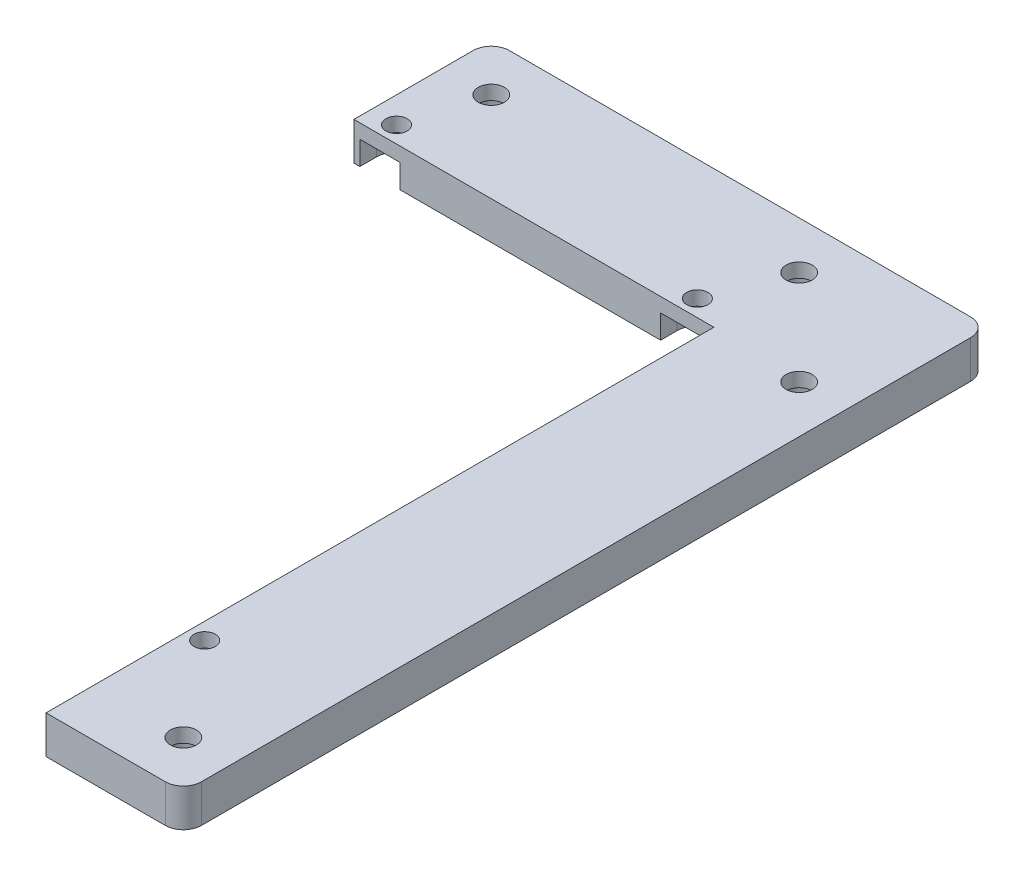
ISO-10303-21;
HEADER;
FILE_DESCRIPTION(('STEP AP214'),'2;1');
FILE_NAME('part.step','',(''),(''),'','','');
FILE_SCHEMA(('AUTOMOTIVE_DESIGN { 1 0 10303 214 1 1 1 1 }'));
ENDSEC;
DATA;
#1=APPLICATION_CONTEXT('core data for automotive mechanical design processes');
#2=APPLICATION_PROTOCOL_DEFINITION('international standard','automotive_design',2000,#1);
#3=PRODUCT_CONTEXT('',#1,'mechanical');
#4=PRODUCT('Part','Part','',(#3));
#5=PRODUCT_RELATED_PRODUCT_CATEGORY('part','',(#4));
#6=PRODUCT_DEFINITION_FORMATION('','',#4);
#7=PRODUCT_DEFINITION_CONTEXT('part definition',#1,'design');
#8=PRODUCT_DEFINITION('design','',#6,#7);
#9=PRODUCT_DEFINITION_SHAPE('','',#8);
#10=(LENGTH_UNIT() NAMED_UNIT(*) SI_UNIT(.MILLI.,.METRE.));
#11=(NAMED_UNIT(*) PLANE_ANGLE_UNIT() SI_UNIT($,.RADIAN.));
#12=(NAMED_UNIT(*) SI_UNIT($,.STERADIAN.) SOLID_ANGLE_UNIT());
#13=UNCERTAINTY_MEASURE_WITH_UNIT(LENGTH_MEASURE(1.E-05),#10,'distance_accuracy_value','');
#14=(GEOMETRIC_REPRESENTATION_CONTEXT(3) GLOBAL_UNCERTAINTY_ASSIGNED_CONTEXT((#13)) GLOBAL_UNIT_ASSIGNED_CONTEXT((#10,
#11,#12)) REPRESENTATION_CONTEXT('',''));
#15=CARTESIAN_POINT('',(0.,0.,0.));
#16=DIRECTION('',(0.,0.,1.));
#17=DIRECTION('',(1.,0.,0.));
#18=AXIS2_PLACEMENT_3D('',#15,#16,#17);
#19=CARTESIAN_POINT('',(-42.5,-4.,-75.));
#20=DIRECTION('',(0.,1.,0.));
#21=DIRECTION('',(0.,0.,1.));
#22=AXIS2_PLACEMENT_3D('',#19,#20,#21);
#23=CYLINDRICAL_SURFACE('',#22,2.75000000000001);
#24=CARTESIAN_POINT('',(-42.5,4.,-75.));
#25=DIRECTION('',(0.,1.,0.));
#26=DIRECTION('',(0.,0.,1.));
#27=AXIS2_PLACEMENT_3D('',#24,#25,#26);
#28=CIRCLE('',#27,2.75000000000001);
#29=CARTESIAN_POINT('',(-42.5,4.,-72.25));
#30=VERTEX_POINT('',#29);
#31=EDGE_CURVE('E361',#30,#30,#28,.T.);
#32=ORIENTED_EDGE('',*,*,#31,.T.);
#33=EDGE_LOOP('',(#32));
#34=FACE_BOUND('',#33,.T.);
#35=CARTESIAN_POINT('',(-42.5,1.,-75.));
#36=DIRECTION('',(0.,-1.,0.));
#37=DIRECTION('',(0.,0.,-1.));
#38=AXIS2_PLACEMENT_3D('',#35,#36,#37);
#39=CIRCLE('',#38,2.75000000000001);
#40=CARTESIAN_POINT('',(-42.5,1.,-77.75));
#41=VERTEX_POINT('',#40);
#42=EDGE_CURVE('E47',#41,#41,#39,.F.);
#43=ORIENTED_EDGE('',*,*,#42,.F.);
#44=EDGE_LOOP('',(#43));
#45=FACE_BOUND('',#44,.T.);
#46=ADVANCED_FACE('F43',(#34,#45),#23,.F.);
#47=CARTESIAN_POINT('',(22.5,-4.,-75.));
#48=DIRECTION('',(0.,1.,0.));
#49=DIRECTION('',(0.,0.,1.));
#50=AXIS2_PLACEMENT_3D('',#47,#48,#49);
#51=CYLINDRICAL_SURFACE('',#50,2.75000000000001);
#52=CARTESIAN_POINT('',(22.5,4.,-75.));
#53=DIRECTION('',(0.,1.,0.));
#54=DIRECTION('',(0.,0.,1.));
#55=AXIS2_PLACEMENT_3D('',#52,#53,#54);
#56=CIRCLE('',#55,2.75000000000001);
#57=CARTESIAN_POINT('',(22.5,4.,-72.25));
#58=VERTEX_POINT('',#57);
#59=EDGE_CURVE('E357',#58,#58,#56,.T.);
#60=ORIENTED_EDGE('',*,*,#59,.T.);
#61=EDGE_LOOP('',(#60));
#62=FACE_BOUND('',#61,.T.);
#63=CARTESIAN_POINT('',(22.5,1.,-75.));
#64=DIRECTION('',(0.,-1.,0.));
#65=DIRECTION('',(0.,0.,-1.));
#66=AXIS2_PLACEMENT_3D('',#63,#64,#65);
#67=CIRCLE('',#66,2.75000000000001);
#68=CARTESIAN_POINT('',(22.5,1.,-77.75));
#69=VERTEX_POINT('',#68);
#70=EDGE_CURVE('E480',#69,#69,#67,.F.);
#71=ORIENTED_EDGE('',*,*,#70,.F.);
#72=EDGE_LOOP('',(#71));
#73=FACE_BOUND('',#72,.T.);
#74=ADVANCED_FACE('F492',(#62,#73),#51,.F.);
#75=CARTESIAN_POINT('',(42.5,-4.,75.));
#76=DIRECTION('',(0.,1.,0.));
#77=DIRECTION('',(0.,0.,1.));
#78=AXIS2_PLACEMENT_3D('',#75,#76,#77);
#79=CYLINDRICAL_SURFACE('',#78,2.75000000000001);
#80=CARTESIAN_POINT('',(42.5,4.,75.));
#81=DIRECTION('',(0.,1.,0.));
#82=DIRECTION('',(0.,0.,1.));
#83=AXIS2_PLACEMENT_3D('',#80,#81,#82);
#84=CIRCLE('',#83,2.75000000000001);
#85=CARTESIAN_POINT('',(42.5,4.,77.75));
#86=VERTEX_POINT('',#85);
#87=EDGE_CURVE('E353',#86,#86,#84,.T.);
#88=ORIENTED_EDGE('',*,*,#87,.T.);
#89=EDGE_LOOP('',(#88));
#90=FACE_BOUND('',#89,.T.);
#91=CARTESIAN_POINT('',(42.5,1.,75.));
#92=DIRECTION('',(0.,-1.,0.));
#93=DIRECTION('',(0.,0.,-1.));
#94=AXIS2_PLACEMENT_3D('',#91,#92,#93);
#95=CIRCLE('',#94,2.75000000000001);
#96=CARTESIAN_POINT('',(42.5,1.,72.25));
#97=VERTEX_POINT('',#96);
#98=EDGE_CURVE('E477',#97,#97,#95,.F.);
#99=ORIENTED_EDGE('',*,*,#98,.F.);
#100=EDGE_LOOP('',(#99));
#101=FACE_BOUND('',#100,.T.);
#102=ADVANCED_FACE('F498',(#90,#101),#79,.F.);
#103=CARTESIAN_POINT('',(42.5,-4.,-55.));
#104=DIRECTION('',(0.,1.,0.));
#105=DIRECTION('',(0.,0.,1.));
#106=AXIS2_PLACEMENT_3D('',#103,#104,#105);
#107=CYLINDRICAL_SURFACE('',#106,2.75000000000001);
#108=CARTESIAN_POINT('',(42.5,4.,-55.));
#109=DIRECTION('',(0.,1.,0.));
#110=DIRECTION('',(0.,0.,1.));
#111=AXIS2_PLACEMENT_3D('',#108,#109,#110);
#112=CIRCLE('',#111,2.75000000000001);
#113=CARTESIAN_POINT('',(42.5,4.,-52.25));
#114=VERTEX_POINT('',#113);
#115=EDGE_CURVE('E349',#114,#114,#112,.T.);
#116=ORIENTED_EDGE('',*,*,#115,.T.);
#117=EDGE_LOOP('',(#116));
#118=FACE_BOUND('',#117,.T.);
#119=CARTESIAN_POINT('',(42.5,1.,-55.));
#120=DIRECTION('',(0.,-1.,0.));
#121=DIRECTION('',(0.,0.,-1.));
#122=AXIS2_PLACEMENT_3D('',#119,#120,#121);
#123=CIRCLE('',#122,2.75000000000001);
#124=CARTESIAN_POINT('',(42.5,1.,-57.75));
#125=VERTEX_POINT('',#124);
#126=EDGE_CURVE('E473',#125,#125,#123,.F.);
#127=ORIENTED_EDGE('',*,*,#126,.F.);
#128=EDGE_LOOP('',(#127));
#129=FACE_BOUND('',#128,.T.);
#130=ADVANCED_FACE('F507',(#118,#129),#107,.F.);
#131=CARTESIAN_POINT('',(-47.,-4.,-59.5));
#132=DIRECTION('',(0.,1.,0.));
#133=DIRECTION('',(0.,0.,1.));
#134=AXIS2_PLACEMENT_3D('',#131,#132,#133);
#135=CYLINDRICAL_SURFACE('',#134,2.25);
#136=CARTESIAN_POINT('',(-47.,4.,-59.5));
#137=DIRECTION('',(0.,1.,0.));
#138=DIRECTION('',(0.,0.,1.));
#139=AXIS2_PLACEMENT_3D('',#136,#137,#138);
#140=CIRCLE('',#139,2.25);
#141=CARTESIAN_POINT('',(-47.,4.,-57.25));
#142=VERTEX_POINT('',#141);
#143=EDGE_CURVE('E345',#142,#142,#140,.T.);
#144=ORIENTED_EDGE('',*,*,#143,.T.);
#145=EDGE_LOOP('',(#144));
#146=FACE_BOUND('',#145,.T.);
#147=CARTESIAN_POINT('',(-47.,1.,-59.5));
#148=DIRECTION('',(0.,-1.,0.));
#149=DIRECTION('',(0.,0.,-1.));
#150=AXIS2_PLACEMENT_3D('',#147,#148,#149);
#151=CIRCLE('',#150,2.25);
#152=CARTESIAN_POINT('',(-47.,1.,-61.75));
#153=VERTEX_POINT('',#152);
#154=EDGE_CURVE('E469',#153,#153,#151,.F.);
#155=ORIENTED_EDGE('',*,*,#154,.F.);
#156=EDGE_LOOP('',(#155));
#157=FACE_BOUND('',#156,.T.);
#158=ADVANCED_FACE('F511',(#146,#157),#135,.F.);
#159=CARTESIAN_POINT('',(16.5,-4.,-59.5));
#160=DIRECTION('',(0.,1.,0.));
#161=DIRECTION('',(0.,0.,1.));
#162=AXIS2_PLACEMENT_3D('',#159,#160,#161);
#163=CYLINDRICAL_SURFACE('',#162,2.25);
#164=CARTESIAN_POINT('',(16.5,4.,-59.5));
#165=DIRECTION('',(0.,1.,0.));
#166=DIRECTION('',(0.,0.,1.));
#167=AXIS2_PLACEMENT_3D('',#164,#165,#166);
#168=CIRCLE('',#167,2.25);
#169=CARTESIAN_POINT('',(16.5,4.,-57.25));
#170=VERTEX_POINT('',#169);
#171=EDGE_CURVE('E341',#170,#170,#168,.T.);
#172=ORIENTED_EDGE('',*,*,#171,.T.);
#173=EDGE_LOOP('',(#172));
#174=FACE_BOUND('',#173,.T.);
#175=CARTESIAN_POINT('',(16.5,1.,-59.5));
#176=DIRECTION('',(0.,-1.,0.));
#177=DIRECTION('',(0.,0.,-1.));
#178=AXIS2_PLACEMENT_3D('',#175,#176,#177);
#179=CIRCLE('',#178,2.25);
#180=CARTESIAN_POINT('',(16.5,1.,-61.75));
#181=VERTEX_POINT('',#180);
#182=EDGE_CURVE('E464',#181,#181,#179,.F.);
#183=ORIENTED_EDGE('',*,*,#182,.F.);
#184=EDGE_LOOP('',(#183));
#185=FACE_BOUND('',#184,.T.);
#186=ADVANCED_FACE('F514',(#174,#185),#163,.F.);
#187=CARTESIAN_POINT('',(27.,-4.,55.));
#188=DIRECTION('',(0.,1.,0.));
#189=DIRECTION('',(0.,0.,1.));
#190=AXIS2_PLACEMENT_3D('',#187,#188,#189);
#191=CYLINDRICAL_SURFACE('',#190,2.25);
#192=CARTESIAN_POINT('',(27.,4.,55.));
#193=DIRECTION('',(0.,1.,0.));
#194=DIRECTION('',(0.,0.,1.));
#195=AXIS2_PLACEMENT_3D('',#192,#193,#194);
#196=CIRCLE('',#195,2.25);
#197=CARTESIAN_POINT('',(27.,4.,57.25));
#198=VERTEX_POINT('',#197);
#199=EDGE_CURVE('E337',#198,#198,#196,.T.);
#200=ORIENTED_EDGE('',*,*,#199,.T.);
#201=EDGE_LOOP('',(#200));
#202=FACE_BOUND('',#201,.T.);
#203=CARTESIAN_POINT('',(27.,1.,55.));
#204=DIRECTION('',(0.,-1.,0.));
#205=DIRECTION('',(0.,0.,-1.));
#206=AXIS2_PLACEMENT_3D('',#203,#204,#205);
#207=CIRCLE('',#206,2.25);
#208=CARTESIAN_POINT('',(27.,1.,52.75));
#209=VERTEX_POINT('',#208);
#210=EDGE_CURVE('E460',#209,#209,#207,.F.);
#211=ORIENTED_EDGE('',*,*,#210,.F.);
#212=EDGE_LOOP('',(#211));
#213=FACE_BOUND('',#212,.T.);
#214=ADVANCED_FACE('F45',(#202,#213),#191,.F.);
#215=CARTESIAN_POINT('',(-48.6882281391012,-4.,-81.1882281391012));
#216=DIRECTION('',(0.,1.,0.));
#217=DIRECTION('',(0.,0.,1.));
#218=AXIS2_PLACEMENT_3D('',#215,#216,#217);
#219=CYLINDRICAL_SURFACE('',#218,3.8117718608988);
#220=DIRECTION('',(0.,1.,0.));
#221=VECTOR('',#220,1.);
#222=CARTESIAN_POINT('',(-52.5,-4.,-81.1882281391012));
#223=LINE('',#222,#221);
#224=CARTESIAN_POINT('',(-52.5,-4.,-81.1882281391012));
#225=VERTEX_POINT('',#224);
#226=CARTESIAN_POINT('',(-52.5,4.,-81.1882281391012));
#227=VERTEX_POINT('',#226);
#228=EDGE_CURVE('E436',#225,#227,#223,.T.);
#229=ORIENTED_EDGE('',*,*,#228,.T.);
#230=CARTESIAN_POINT('',(-48.6882281391012,4.,-81.1882281391012));
#231=DIRECTION('',(0.,1.,0.));
#232=DIRECTION('',(0.,0.,1.));
#233=AXIS2_PLACEMENT_3D('',#230,#231,#232);
#234=CIRCLE('',#233,3.8117718608988);
#235=CARTESIAN_POINT('',(-48.6882281391012,4.,-85.));
#236=VERTEX_POINT('',#235);
#237=EDGE_CURVE('E365',#227,#236,#234,.F.);
#238=ORIENTED_EDGE('',*,*,#237,.T.);
#239=DIRECTION('',(0.,1.,0.));
#240=VECTOR('',#239,1.);
#241=CARTESIAN_POINT('',(-48.6882281391012,-4.,-85.));
#242=LINE('',#241,#240);
#243=CARTESIAN_POINT('',(-48.6882281391012,-4.,-85.));
#244=VERTEX_POINT('',#243);
#245=EDGE_CURVE('E11',#244,#236,#242,.T.);
#246=ORIENTED_EDGE('',*,*,#245,.F.);
#247=CARTESIAN_POINT('',(-48.6882281391012,-4.,-81.1882281391012));
#248=DIRECTION('',(0.,1.,0.));
#249=DIRECTION('',(0.,0.,1.));
#250=AXIS2_PLACEMENT_3D('',#247,#248,#249);
#251=CIRCLE('',#250,3.8117718608988);
#252=EDGE_CURVE('E401',#225,#244,#251,.F.);
#253=ORIENTED_EDGE('',*,*,#252,.F.);
#254=EDGE_LOOP('',(#229,#238,#246,#253));
#255=FACE_BOUND('',#254,.T.);
#256=ADVANCED_FACE('F502',(#255),#219,.T.);
#257=CARTESIAN_POINT('',(0.,-4.,-85.));
#258=DIRECTION('',(0.,0.,1.));
#259=DIRECTION('',(1.,0.,0.));
#260=AXIS2_PLACEMENT_3D('',#257,#258,#259);
#261=PLANE('',#260);
#262=ORIENTED_EDGE('',*,*,#245,.T.);
#263=DIRECTION('',(1.,0.,0.));
#264=VECTOR('',#263,1.);
#265=CARTESIAN_POINT('',(0.,4.,-85.));
#266=LINE('',#265,#264);
#267=CARTESIAN_POINT('',(48.6882281391012,4.,-85.));
#268=VERTEX_POINT('',#267);
#269=EDGE_CURVE('E397',#236,#268,#266,.T.);
#270=ORIENTED_EDGE('',*,*,#269,.T.);
#271=DIRECTION('',(0.,1.,0.));
#272=VECTOR('',#271,1.);
#273=CARTESIAN_POINT('',(48.6882281391012,-4.,-85.));
#274=LINE('',#273,#272);
#275=CARTESIAN_POINT('',(48.6882281391012,-4.,-85.));
#276=VERTEX_POINT('',#275);
#277=EDGE_CURVE('E53',#276,#268,#274,.T.);
#278=ORIENTED_EDGE('',*,*,#277,.F.);
#279=DIRECTION('',(1.,0.,0.));
#280=VECTOR('',#279,1.);
#281=CARTESIAN_POINT('',(0.,-4.,-85.));
#282=LINE('',#281,#280);
#283=EDGE_CURVE('E434',#244,#276,#282,.T.);
#284=ORIENTED_EDGE('',*,*,#283,.F.);
#285=EDGE_LOOP('',(#262,#270,#278,#284));
#286=FACE_BOUND('',#285,.T.);
#287=ADVANCED_FACE('F605',(#286),#261,.F.);
#288=CARTESIAN_POINT('',(48.6882281391012,-4.,-81.1882281391012));
#289=DIRECTION('',(0.,1.,0.));
#290=DIRECTION('',(0.,0.,1.));
#291=AXIS2_PLACEMENT_3D('',#288,#289,#290);
#292=CYLINDRICAL_SURFACE('',#291,3.8117718608988);
#293=ORIENTED_EDGE('',*,*,#277,.T.);
#294=CARTESIAN_POINT('',(48.6882281391012,4.,-81.1882281391012));
#295=DIRECTION('',(0.,1.,0.));
#296=DIRECTION('',(0.,0.,1.));
#297=AXIS2_PLACEMENT_3D('',#294,#295,#296);
#298=CIRCLE('',#297,3.8117718608988);
#299=CARTESIAN_POINT('',(52.5,4.,-81.1882281391012));
#300=VERTEX_POINT('',#299);
#301=EDGE_CURVE('E393',#268,#300,#298,.F.);
#302=ORIENTED_EDGE('',*,*,#301,.T.);
#303=DIRECTION('',(0.,1.,0.));
#304=VECTOR('',#303,1.);
#305=CARTESIAN_POINT('',(52.5,-4.,-81.1882281391012));
#306=LINE('',#305,#304);
#307=CARTESIAN_POINT('',(52.5,-4.,-81.1882281391012));
#308=VERTEX_POINT('',#307);
#309=EDGE_CURVE('E440',#308,#300,#306,.T.);
#310=ORIENTED_EDGE('',*,*,#309,.F.);
#311=CARTESIAN_POINT('',(48.6882281391012,-4.,-81.1882281391012));
#312=DIRECTION('',(0.,1.,0.));
#313=DIRECTION('',(0.,0.,1.));
#314=AXIS2_PLACEMENT_3D('',#311,#312,#313);
#315=CIRCLE('',#314,3.8117718608988);
#316=EDGE_CURVE('E431',#276,#308,#315,.F.);
#317=ORIENTED_EDGE('',*,*,#316,.F.);
#318=EDGE_LOOP('',(#293,#302,#310,#317));
#319=FACE_BOUND('',#318,.T.);
#320=ADVANCED_FACE('F608',(#319),#292,.T.);
#321=CARTESIAN_POINT('',(52.5,-4.,0.));
#322=DIRECTION('',(1.,0.,0.));
#323=DIRECTION('',(0.,0.,-1.));
#324=AXIS2_PLACEMENT_3D('',#321,#322,#323);
#325=PLANE('',#324);
#326=ORIENTED_EDGE('',*,*,#309,.T.);
#327=DIRECTION('',(0.,0.,-1.));
#328=VECTOR('',#327,1.);
#329=CARTESIAN_POINT('',(52.5,4.,0.));
#330=LINE('',#329,#328);
#331=CARTESIAN_POINT('',(52.5,4.,81.1882281391012));
#332=VERTEX_POINT('',#331);
#333=EDGE_CURVE('E389',#332,#300,#330,.T.);
#334=ORIENTED_EDGE('',*,*,#333,.F.);
#335=DIRECTION('',(0.,1.,0.));
#336=VECTOR('',#335,1.);
#337=CARTESIAN_POINT('',(52.5,-4.,81.1882281391012));
#338=LINE('',#337,#336);
#339=CARTESIAN_POINT('',(52.5,-4.,81.1882281391012));
#340=VERTEX_POINT('',#339);
#341=EDGE_CURVE('E443',#340,#332,#338,.T.);
#342=ORIENTED_EDGE('',*,*,#341,.F.);
#343=DIRECTION('',(0.,0.,-1.));
#344=VECTOR('',#343,1.);
#345=CARTESIAN_POINT('',(52.5,-4.,0.));
#346=LINE('',#345,#344);
#347=EDGE_CURVE('E427',#340,#308,#346,.T.);
#348=ORIENTED_EDGE('',*,*,#347,.T.);
#349=EDGE_LOOP('',(#326,#334,#342,#348));
#350=FACE_BOUND('',#349,.T.);
#351=ADVANCED_FACE('F612',(#350),#325,.T.);
#352=CARTESIAN_POINT('',(48.6882281391012,-4.,81.1882281391012));
#353=DIRECTION('',(0.,1.,0.));
#354=DIRECTION('',(0.,0.,1.));
#355=AXIS2_PLACEMENT_3D('',#352,#353,#354);
#356=CYLINDRICAL_SURFACE('',#355,3.8117718608988);
#357=ORIENTED_EDGE('',*,*,#341,.T.);
#358=CARTESIAN_POINT('',(48.6882281391012,4.,81.1882281391012));
#359=DIRECTION('',(0.,1.,0.));
#360=DIRECTION('',(0.,0.,1.));
#361=AXIS2_PLACEMENT_3D('',#358,#359,#360);
#362=CIRCLE('',#361,3.8117718608988);
#363=CARTESIAN_POINT('',(48.6882281391012,4.,85.));
#364=VERTEX_POINT('',#363);
#365=EDGE_CURVE('E385',#364,#332,#362,.T.);
#366=ORIENTED_EDGE('',*,*,#365,.F.);
#367=DIRECTION('',(0.,1.,0.));
#368=VECTOR('',#367,1.);
#369=CARTESIAN_POINT('',(48.6882281391012,-4.,85.));
#370=LINE('',#369,#368);
#371=CARTESIAN_POINT('',(48.6882281391012,-4.,85.));
#372=VERTEX_POINT('',#371);
#373=EDGE_CURVE('E446',#372,#364,#370,.T.);
#374=ORIENTED_EDGE('',*,*,#373,.F.);
#375=CARTESIAN_POINT('',(48.6882281391012,-4.,81.1882281391012));
#376=DIRECTION('',(0.,1.,0.));
#377=DIRECTION('',(0.,0.,1.));
#378=AXIS2_PLACEMENT_3D('',#375,#376,#377);
#379=CIRCLE('',#378,3.8117718608988);
#380=EDGE_CURVE('E423',#372,#340,#379,.T.);
#381=ORIENTED_EDGE('',*,*,#380,.T.);
#382=EDGE_LOOP('',(#357,#366,#374,#381));
#383=FACE_BOUND('',#382,.T.);
#384=ADVANCED_FACE('F616',(#383),#356,.T.);
#385=CARTESIAN_POINT('',(0.,-4.,85.));
#386=DIRECTION('',(0.,0.,1.));
#387=DIRECTION('',(1.,0.,0.));
#388=AXIS2_PLACEMENT_3D('',#385,#386,#387);
#389=PLANE('',#388);
#390=ORIENTED_EDGE('',*,*,#373,.T.);
#391=DIRECTION('',(1.,0.,0.));
#392=VECTOR('',#391,1.);
#393=CARTESIAN_POINT('',(0.,4.,85.));
#394=LINE('',#393,#392);
#395=CARTESIAN_POINT('',(23.5,4.,85.));
#396=VERTEX_POINT('',#395);
#397=EDGE_CURVE('E381',#396,#364,#394,.T.);
#398=ORIENTED_EDGE('',*,*,#397,.F.);
#399=DIRECTION('',(0.,1.,0.));
#400=VECTOR('',#399,1.);
#401=CARTESIAN_POINT('',(23.5,-4.,85.));
#402=LINE('',#401,#400);
#403=CARTESIAN_POINT('',(23.5,-4.,85.));
#404=VERTEX_POINT('',#403);
#405=EDGE_CURVE('E449',#404,#396,#402,.T.);
#406=ORIENTED_EDGE('',*,*,#405,.F.);
#407=DIRECTION('',(1.,0.,0.));
#408=VECTOR('',#407,1.);
#409=CARTESIAN_POINT('',(0.,-4.,85.));
#410=LINE('',#409,#408);
#411=EDGE_CURVE('E419',#404,#372,#410,.T.);
#412=ORIENTED_EDGE('',*,*,#411,.T.);
#413=EDGE_LOOP('',(#390,#398,#406,#412));
#414=FACE_BOUND('',#413,.T.);
#415=ADVANCED_FACE('F620',(#414),#389,.T.);
#416=CARTESIAN_POINT('',(23.5,-4.,0.));
#417=DIRECTION('',(-1.,0.,0.));
#418=DIRECTION('',(0.,0.,1.));
#419=AXIS2_PLACEMENT_3D('',#416,#417,#418);
#420=PLANE('',#419);
#421=DIRECTION('',(0.,-1.,0.));
#422=VECTOR('',#421,1.);
#423=CARTESIAN_POINT('',(23.5,1.,50.75));
#424=LINE('',#423,#422);
#425=CARTESIAN_POINT('',(23.5,1.,50.75));
#426=VERTEX_POINT('',#425);
#427=CARTESIAN_POINT('',(23.5,-4.,50.75));
#428=VERTEX_POINT('',#427);
#429=EDGE_CURVE('E312',#426,#428,#424,.T.);
#430=ORIENTED_EDGE('',*,*,#429,.F.);
#431=DIRECTION('',(0.,0.,-1.));
#432=VECTOR('',#431,1.);
#433=CARTESIAN_POINT('',(23.5,1.,59.25));
#434=LINE('',#433,#432);
#435=CARTESIAN_POINT('',(23.5,1.,59.25));
#436=VERTEX_POINT('',#435);
#437=EDGE_CURVE('E294',#436,#426,#434,.T.);
#438=ORIENTED_EDGE('',*,*,#437,.F.);
#439=DIRECTION('',(0.,-1.,0.));
#440=VECTOR('',#439,1.);
#441=CARTESIAN_POINT('',(23.5,1.,59.25));
#442=LINE('',#441,#440);
#443=CARTESIAN_POINT('',(23.5,-4.,59.25));
#444=VERTEX_POINT('',#443);
#445=EDGE_CURVE('E315',#436,#444,#442,.T.);
#446=ORIENTED_EDGE('',*,*,#445,.T.);
#447=DIRECTION('',(0.,0.,1.));
#448=VECTOR('',#447,1.);
#449=CARTESIAN_POINT('',(23.5,-4.,0.));
#450=LINE('',#449,#448);
#451=EDGE_CURVE('E413',#444,#404,#450,.T.);
#452=ORIENTED_EDGE('',*,*,#451,.T.);
#453=ORIENTED_EDGE('',*,*,#405,.T.);
#454=DIRECTION('',(0.,0.,1.));
#455=VECTOR('',#454,1.);
#456=CARTESIAN_POINT('',(23.5,4.,0.));
#457=LINE('',#456,#455);
#458=CARTESIAN_POINT('',(23.5,4.,-56.));
#459=VERTEX_POINT('',#458);
#460=EDGE_CURVE('E377',#459,#396,#457,.T.);
#461=ORIENTED_EDGE('',*,*,#460,.F.);
#462=DIRECTION('',(0.,1.,0.));
#463=VECTOR('',#462,1.);
#464=CARTESIAN_POINT('',(23.5,-4.,-56.));
#465=LINE('',#464,#463);
#466=CARTESIAN_POINT('',(23.5,-4.,-56.));
#467=VERTEX_POINT('',#466);
#468=EDGE_CURVE('E452',#467,#459,#465,.T.);
#469=ORIENTED_EDGE('',*,*,#468,.F.);
#470=EDGE_CURVE('E415',#467,#428,#450,.T.);
#471=ORIENTED_EDGE('',*,*,#470,.T.);
#472=EDGE_LOOP('',(#430,#438,#446,#452,#453,#461,#469,#471));
#473=FACE_BOUND('',#472,.T.);
#474=ADVANCED_FACE('F624',(#473),#420,.T.);
#475=CARTESIAN_POINT('',(0.,-4.,-56.));
#476=DIRECTION('',(0.,0.,1.));
#477=DIRECTION('',(1.,0.,0.));
#478=AXIS2_PLACEMENT_3D('',#475,#476,#477);
#479=PLANE('',#478);
#480=DIRECTION('',(0.,-1.,0.));
#481=VECTOR('',#480,1.);
#482=CARTESIAN_POINT('',(-51.25,1.,-56.));
#483=LINE('',#482,#481);
#484=CARTESIAN_POINT('',(-51.25,1.,-56.));
#485=VERTEX_POINT('',#484);
#486=CARTESIAN_POINT('',(-51.25,-4.,-56.));
#487=VERTEX_POINT('',#486);
#488=EDGE_CURVE('E266',#485,#487,#483,.T.);
#489=ORIENTED_EDGE('',*,*,#488,.F.);
#490=DIRECTION('',(-1.,0.,0.));
#491=VECTOR('',#490,1.);
#492=CARTESIAN_POINT('',(-51.25,1.,-56.));
#493=LINE('',#492,#491);
#494=CARTESIAN_POINT('',(-42.75,1.,-56.));
#495=VERTEX_POINT('',#494);
#496=EDGE_CURVE('E248',#495,#485,#493,.T.);
#497=ORIENTED_EDGE('',*,*,#496,.F.);
#498=DIRECTION('',(0.,-1.,0.));
#499=VECTOR('',#498,1.);
#500=CARTESIAN_POINT('',(-42.75,1.,-56.));
#501=LINE('',#500,#499);
#502=CARTESIAN_POINT('',(-42.75,-4.,-56.));
#503=VERTEX_POINT('',#502);
#504=EDGE_CURVE('E269',#495,#503,#501,.T.);
#505=ORIENTED_EDGE('',*,*,#504,.T.);
#506=DIRECTION('',(1.,0.,0.));
#507=VECTOR('',#506,1.);
#508=CARTESIAN_POINT('',(0.,-4.,-56.));
#509=LINE('',#508,#507);
#510=CARTESIAN_POINT('',(12.25,-4.,-56.));
#511=VERTEX_POINT('',#510);
#512=EDGE_CURVE('E414',#503,#511,#509,.T.);
#513=ORIENTED_EDGE('',*,*,#512,.T.);
#514=DIRECTION('',(0.,-1.,0.));
#515=VECTOR('',#514,1.);
#516=CARTESIAN_POINT('',(12.25,1.,-56.));
#517=LINE('',#516,#515);
#518=CARTESIAN_POINT('',(12.25,1.,-56.));
#519=VERTEX_POINT('',#518);
#520=EDGE_CURVE('E234',#519,#511,#517,.T.);
#521=ORIENTED_EDGE('',*,*,#520,.F.);
#522=DIRECTION('',(-1.,0.,0.));
#523=VECTOR('',#522,1.);
#524=CARTESIAN_POINT('',(12.25,1.,-56.));
#525=LINE('',#524,#523);
#526=CARTESIAN_POINT('',(20.75,1.,-56.));
#527=VERTEX_POINT('',#526);
#528=EDGE_CURVE('E205',#527,#519,#525,.T.);
#529=ORIENTED_EDGE('',*,*,#528,.F.);
#530=DIRECTION('',(0.,-1.,0.));
#531=VECTOR('',#530,1.);
#532=CARTESIAN_POINT('',(20.75,1.,-56.));
#533=LINE('',#532,#531);
#534=CARTESIAN_POINT('',(20.75,-4.,-56.));
#535=VERTEX_POINT('',#534);
#536=EDGE_CURVE('E195',#527,#535,#533,.T.);
#537=ORIENTED_EDGE('',*,*,#536,.T.);
#538=EDGE_CURVE('E408',#535,#467,#509,.T.);
#539=ORIENTED_EDGE('',*,*,#538,.T.);
#540=ORIENTED_EDGE('',*,*,#468,.T.);
#541=DIRECTION('',(1.,0.,0.));
#542=VECTOR('',#541,1.);
#543=CARTESIAN_POINT('',(0.,4.,-56.));
#544=LINE('',#543,#542);
#545=CARTESIAN_POINT('',(-52.5,4.,-56.));
#546=VERTEX_POINT('',#545);
#547=EDGE_CURVE('E373',#546,#459,#544,.T.);
#548=ORIENTED_EDGE('',*,*,#547,.F.);
#549=DIRECTION('',(0.,1.,0.));
#550=VECTOR('',#549,1.);
#551=CARTESIAN_POINT('',(-52.5,-4.,-56.));
#552=LINE('',#551,#550);
#553=CARTESIAN_POINT('',(-52.5,-4.,-56.));
#554=VERTEX_POINT('',#553);
#555=EDGE_CURVE('E455',#554,#546,#552,.T.);
#556=ORIENTED_EDGE('',*,*,#555,.F.);
#557=EDGE_CURVE('E409',#554,#487,#509,.T.);
#558=ORIENTED_EDGE('',*,*,#557,.T.);
#559=EDGE_LOOP('',(#489,#497,#505,#513,#521,#529,#537,#539,#540,#548,#556,#558));
#560=FACE_BOUND('',#559,.T.);
#561=ADVANCED_FACE('F628',(#560),#479,.T.);
#562=CARTESIAN_POINT('',(-52.5,-4.,0.));
#563=DIRECTION('',(1.,0.,0.));
#564=DIRECTION('',(0.,0.,-1.));
#565=AXIS2_PLACEMENT_3D('',#562,#563,#564);
#566=PLANE('',#565);
#567=ORIENTED_EDGE('',*,*,#555,.T.);
#568=DIRECTION('',(0.,0.,-1.));
#569=VECTOR('',#568,1.);
#570=CARTESIAN_POINT('',(-52.5,4.,0.));
#571=LINE('',#570,#569);
#572=EDGE_CURVE('E369',#546,#227,#571,.T.);
#573=ORIENTED_EDGE('',*,*,#572,.T.);
#574=ORIENTED_EDGE('',*,*,#228,.F.);
#575=DIRECTION('',(0.,0.,-1.));
#576=VECTOR('',#575,1.);
#577=CARTESIAN_POINT('',(-52.5,-4.,0.));
#578=LINE('',#577,#576);
#579=EDGE_CURVE('E405',#554,#225,#578,.T.);
#580=ORIENTED_EDGE('',*,*,#579,.F.);
#581=EDGE_LOOP('',(#567,#573,#574,#580));
#582=FACE_BOUND('',#581,.T.);
#583=ADVANCED_FACE('F603',(#582),#566,.F.);
#584=CARTESIAN_POINT('',(0.,-4.,0.));
#585=DIRECTION('',(0.,1.,0.));
#586=DIRECTION('',(0.,0.,1.));
#587=AXIS2_PLACEMENT_3D('',#584,#585,#586);
#588=PLANE('',#587);
#589=CARTESIAN_POINT('',(42.5,-4.,75.));
#590=DIRECTION('',(0.,-1.,0.));
#591=DIRECTION('',(0.,0.,-1.));
#592=AXIS2_PLACEMENT_3D('',#589,#590,#591);
#593=CIRCLE('',#592,4.25);
#594=CARTESIAN_POINT('',(42.5,-4.,70.75));
#595=VERTEX_POINT('',#594);
#596=EDGE_CURVE('E218',#595,#595,#593,.T.);
#597=ORIENTED_EDGE('',*,*,#596,.F.);
#598=EDGE_LOOP('',(#597));
#599=FACE_BOUND('',#598,.T.);
#600=CARTESIAN_POINT('',(42.5,-4.,-55.));
#601=DIRECTION('',(0.,-1.,0.));
#602=DIRECTION('',(0.,0.,-1.));
#603=AXIS2_PLACEMENT_3D('',#600,#601,#602);
#604=CIRCLE('',#603,4.25);
#605=CARTESIAN_POINT('',(42.5,-4.,-59.25));
#606=VERTEX_POINT('',#605);
#607=EDGE_CURVE('E326',#606,#606,#604,.T.);
#608=ORIENTED_EDGE('',*,*,#607,.F.);
#609=EDGE_LOOP('',(#608));
#610=FACE_BOUND('',#609,.T.);
#611=CARTESIAN_POINT('',(22.5,-4.,-75.));
#612=DIRECTION('',(0.,-1.,0.));
#613=DIRECTION('',(0.,0.,-1.));
#614=AXIS2_PLACEMENT_3D('',#611,#612,#613);
#615=CIRCLE('',#614,4.24999999999999);
#616=CARTESIAN_POINT('',(22.5,-4.,-79.25));
#617=VERTEX_POINT('',#616);
#618=EDGE_CURVE('E279',#617,#617,#615,.T.);
#619=ORIENTED_EDGE('',*,*,#618,.F.);
#620=EDGE_LOOP('',(#619));
#621=FACE_BOUND('',#620,.T.);
#622=CARTESIAN_POINT('',(-42.5,-4.,-75.));
#623=DIRECTION('',(0.,-1.,0.));
#624=DIRECTION('',(0.,0.,-1.));
#625=AXIS2_PLACEMENT_3D('',#622,#623,#624);
#626=CIRCLE('',#625,4.24999999999999);
#627=CARTESIAN_POINT('',(-42.5,-4.,-79.25));
#628=VERTEX_POINT('',#627);
#629=EDGE_CURVE('E280',#628,#628,#626,.T.);
#630=ORIENTED_EDGE('',*,*,#629,.F.);
#631=EDGE_LOOP('',(#630));
#632=FACE_BOUND('',#631,.T.);
#633=CARTESIAN_POINT('',(-47.,-4.,-59.5));
#634=DIRECTION('',(0.,-1.,0.));
#635=DIRECTION('',(0.,0.,-1.));
#636=AXIS2_PLACEMENT_3D('',#633,#634,#635);
#637=CIRCLE('',#636,4.24999999999999);
#638=CARTESIAN_POINT('',(-51.25,-4.,-59.5));
#639=VERTEX_POINT('',#638);
#640=CARTESIAN_POINT('',(-42.75,-4.,-59.5));
#641=VERTEX_POINT('',#640);
#642=EDGE_CURVE('E61',#639,#641,#637,.T.);
#643=ORIENTED_EDGE('',*,*,#642,.F.);
#644=DIRECTION('',(0.,0.,-1.));
#645=VECTOR('',#644,1.);
#646=CARTESIAN_POINT('',(-51.25,-4.,-59.5));
#647=LINE('',#646,#645);
#648=EDGE_CURVE('E244',#487,#639,#647,.T.);
#649=ORIENTED_EDGE('',*,*,#648,.F.);
#650=ORIENTED_EDGE('',*,*,#557,.F.);
#651=ORIENTED_EDGE('',*,*,#579,.T.);
#652=ORIENTED_EDGE('',*,*,#252,.T.);
#653=ORIENTED_EDGE('',*,*,#283,.T.);
#654=ORIENTED_EDGE('',*,*,#316,.T.);
#655=ORIENTED_EDGE('',*,*,#347,.F.);
#656=ORIENTED_EDGE('',*,*,#380,.F.);
#657=ORIENTED_EDGE('',*,*,#411,.F.);
#658=ORIENTED_EDGE('',*,*,#451,.F.);
#659=DIRECTION('',(-1.,0.,0.));
#660=VECTOR('',#659,1.);
#661=CARTESIAN_POINT('',(27.,-4.,59.25));
#662=LINE('',#661,#660);
#663=CARTESIAN_POINT('',(27.,-4.,59.25));
#664=VERTEX_POINT('',#663);
#665=EDGE_CURVE('E304',#664,#444,#662,.T.);
#666=ORIENTED_EDGE('',*,*,#665,.F.);
#667=CARTESIAN_POINT('',(27.,-4.,55.));
#668=DIRECTION('',(0.,-1.,0.));
#669=DIRECTION('',(0.,0.,-1.));
#670=AXIS2_PLACEMENT_3D('',#667,#668,#669);
#671=CIRCLE('',#670,4.25);
#672=CARTESIAN_POINT('',(27.,-4.,50.75));
#673=VERTEX_POINT('',#672);
#674=EDGE_CURVE('E233',#673,#664,#671,.T.);
#675=ORIENTED_EDGE('',*,*,#674,.F.);
#676=DIRECTION('',(1.,0.,0.));
#677=VECTOR('',#676,1.);
#678=CARTESIAN_POINT('',(23.5,-4.,50.75));
#679=LINE('',#678,#677);
#680=EDGE_CURVE('E290',#428,#673,#679,.T.);
#681=ORIENTED_EDGE('',*,*,#680,.F.);
#682=ORIENTED_EDGE('',*,*,#470,.F.);
#683=ORIENTED_EDGE('',*,*,#538,.F.);
#684=DIRECTION('',(0.,0.,1.));
#685=VECTOR('',#684,1.);
#686=CARTESIAN_POINT('',(20.75,-4.,-56.));
#687=LINE('',#686,#685);
#688=CARTESIAN_POINT('',(20.75,-4.,-59.5));
#689=VERTEX_POINT('',#688);
#690=EDGE_CURVE('E215',#689,#535,#687,.T.);
#691=ORIENTED_EDGE('',*,*,#690,.F.);
#692=CARTESIAN_POINT('',(16.5,-4.,-59.5));
#693=DIRECTION('',(0.,-1.,0.));
#694=DIRECTION('',(0.,0.,-1.));
#695=AXIS2_PLACEMENT_3D('',#692,#693,#694);
#696=CIRCLE('',#695,4.24999999999999);
#697=CARTESIAN_POINT('',(12.25,-4.,-59.5));
#698=VERTEX_POINT('',#697);
#699=EDGE_CURVE('E69',#698,#689,#696,.T.);
#700=ORIENTED_EDGE('',*,*,#699,.F.);
#701=DIRECTION('',(0.,0.,-1.));
#702=VECTOR('',#701,1.);
#703=CARTESIAN_POINT('',(12.25,-4.,-59.5));
#704=LINE('',#703,#702);
#705=EDGE_CURVE('E211',#511,#698,#704,.T.);
#706=ORIENTED_EDGE('',*,*,#705,.F.);
#707=ORIENTED_EDGE('',*,*,#512,.F.);
#708=DIRECTION('',(0.,0.,1.));
#709=VECTOR('',#708,1.);
#710=CARTESIAN_POINT('',(-42.75,-4.,-56.));
#711=LINE('',#710,#709);
#712=EDGE_CURVE('E258',#641,#503,#711,.T.);
#713=ORIENTED_EDGE('',*,*,#712,.F.);
#714=EDGE_LOOP('',(#643,#649,#650,#651,#652,#653,#654,#655,#656,#657,#658,#666,#675,#681,#682,
#683,#691,#700,#706,#707,#713));
#715=FACE_BOUND('',#714,.T.);
#716=ADVANCED_FACE('F599',(#599,#610,#621,#632,#715),#588,.F.);
#717=CARTESIAN_POINT('',(0.,4.,0.));
#718=DIRECTION('',(0.,1.,0.));
#719=DIRECTION('',(0.,0.,1.));
#720=AXIS2_PLACEMENT_3D('',#717,#718,#719);
#721=PLANE('',#720);
#722=ORIENTED_EDGE('',*,*,#199,.F.);
#723=EDGE_LOOP('',(#722));
#724=FACE_BOUND('',#723,.T.);
#725=ORIENTED_EDGE('',*,*,#171,.F.);
#726=EDGE_LOOP('',(#725));
#727=FACE_BOUND('',#726,.T.);
#728=ORIENTED_EDGE('',*,*,#143,.F.);
#729=EDGE_LOOP('',(#728));
#730=FACE_BOUND('',#729,.T.);
#731=ORIENTED_EDGE('',*,*,#115,.F.);
#732=EDGE_LOOP('',(#731));
#733=FACE_BOUND('',#732,.T.);
#734=ORIENTED_EDGE('',*,*,#87,.F.);
#735=EDGE_LOOP('',(#734));
#736=FACE_BOUND('',#735,.T.);
#737=ORIENTED_EDGE('',*,*,#59,.F.);
#738=EDGE_LOOP('',(#737));
#739=FACE_BOUND('',#738,.T.);
#740=ORIENTED_EDGE('',*,*,#31,.F.);
#741=EDGE_LOOP('',(#740));
#742=FACE_BOUND('',#741,.T.);
#743=ORIENTED_EDGE('',*,*,#237,.F.);
#744=ORIENTED_EDGE('',*,*,#572,.F.);
#745=ORIENTED_EDGE('',*,*,#547,.T.);
#746=ORIENTED_EDGE('',*,*,#460,.T.);
#747=ORIENTED_EDGE('',*,*,#397,.T.);
#748=ORIENTED_EDGE('',*,*,#365,.T.);
#749=ORIENTED_EDGE('',*,*,#333,.T.);
#750=ORIENTED_EDGE('',*,*,#301,.F.);
#751=ORIENTED_EDGE('',*,*,#269,.F.);
#752=EDGE_LOOP('',(#743,#744,#745,#746,#747,#748,#749,#750,#751));
#753=FACE_BOUND('',#752,.T.);
#754=ADVANCED_FACE('F575',(#724,#727,#730,#733,#736,#739,#742,#753),#721,.T.);
#755=CARTESIAN_POINT('',(27.,1.,55.));
#756=DIRECTION('',(0.,-1.,0.));
#757=DIRECTION('',(0.,0.,-1.));
#758=AXIS2_PLACEMENT_3D('',#755,#756,#757);
#759=PLANE('',#758);
#760=CARTESIAN_POINT('',(27.,1.,55.));
#761=DIRECTION('',(0.,-1.,0.));
#762=DIRECTION('',(0.,0.,-1.));
#763=AXIS2_PLACEMENT_3D('',#760,#761,#762);
#764=CIRCLE('',#763,4.25);
#765=CARTESIAN_POINT('',(27.,1.,50.75));
#766=VERTEX_POINT('',#765);
#767=CARTESIAN_POINT('',(27.,1.,59.25));
#768=VERTEX_POINT('',#767);
#769=EDGE_CURVE('E285',#766,#768,#764,.T.);
#770=ORIENTED_EDGE('',*,*,#769,.T.);
#771=DIRECTION('',(-1.,0.,0.));
#772=VECTOR('',#771,1.);
#773=CARTESIAN_POINT('',(27.,1.,59.25));
#774=LINE('',#773,#772);
#775=EDGE_CURVE('E289',#768,#436,#774,.T.);
#776=ORIENTED_EDGE('',*,*,#775,.T.);
#777=ORIENTED_EDGE('',*,*,#437,.T.);
#778=DIRECTION('',(1.,0.,0.));
#779=VECTOR('',#778,1.);
#780=CARTESIAN_POINT('',(23.5,1.,50.75));
#781=LINE('',#780,#779);
#782=EDGE_CURVE('E297',#426,#766,#781,.T.);
#783=ORIENTED_EDGE('',*,*,#782,.T.);
#784=EDGE_LOOP('',(#770,#776,#777,#783));
#785=FACE_BOUND('',#784,.T.);
#786=ORIENTED_EDGE('',*,*,#210,.T.);
#787=EDGE_LOOP('',(#786));
#788=FACE_BOUND('',#787,.T.);
#789=ADVANCED_FACE('F571',(#785,#788),#759,.T.);
#790=CARTESIAN_POINT('',(27.,1.,55.));
#791=DIRECTION('',(0.,-1.,0.));
#792=DIRECTION('',(0.,0.,-1.));
#793=AXIS2_PLACEMENT_3D('',#790,#791,#792);
#794=CYLINDRICAL_SURFACE('',#793,4.25);
#795=ORIENTED_EDGE('',*,*,#674,.T.);
#796=DIRECTION('',(0.,-1.,0.));
#797=VECTOR('',#796,1.);
#798=CARTESIAN_POINT('',(27.,1.,59.25));
#799=LINE('',#798,#797);
#800=EDGE_CURVE('E301',#768,#664,#799,.T.);
#801=ORIENTED_EDGE('',*,*,#800,.F.);
#802=ORIENTED_EDGE('',*,*,#769,.F.);
#803=DIRECTION('',(0.,-1.,0.));
#804=VECTOR('',#803,1.);
#805=CARTESIAN_POINT('',(27.,1.,50.75));
#806=LINE('',#805,#804);
#807=EDGE_CURVE('E284',#766,#673,#806,.T.);
#808=ORIENTED_EDGE('',*,*,#807,.T.);
#809=EDGE_LOOP('',(#795,#801,#802,#808));
#810=FACE_BOUND('',#809,.T.);
#811=ADVANCED_FACE('F574',(#810),#794,.F.);
#812=CARTESIAN_POINT('',(23.5,1.,50.75));
#813=DIRECTION('',(0.,0.,-1.));
#814=DIRECTION('',(-1.,0.,0.));
#815=AXIS2_PLACEMENT_3D('',#812,#813,#814);
#816=PLANE('',#815);
#817=ORIENTED_EDGE('',*,*,#680,.T.);
#818=ORIENTED_EDGE('',*,*,#807,.F.);
#819=ORIENTED_EDGE('',*,*,#782,.F.);
#820=ORIENTED_EDGE('',*,*,#429,.T.);
#821=EDGE_LOOP('',(#817,#818,#819,#820));
#822=FACE_BOUND('',#821,.T.);
#823=ADVANCED_FACE('F577',(#822),#816,.F.);
#824=CARTESIAN_POINT('',(27.,1.,59.25));
#825=DIRECTION('',(0.,0.,1.));
#826=DIRECTION('',(1.,0.,0.));
#827=AXIS2_PLACEMENT_3D('',#824,#825,#826);
#828=PLANE('',#827);
#829=ORIENTED_EDGE('',*,*,#665,.T.);
#830=ORIENTED_EDGE('',*,*,#445,.F.);
#831=ORIENTED_EDGE('',*,*,#775,.F.);
#832=ORIENTED_EDGE('',*,*,#800,.T.);
#833=EDGE_LOOP('',(#829,#830,#831,#832));
#834=FACE_BOUND('',#833,.T.);
#835=ADVANCED_FACE('F565',(#834),#828,.F.);
#836=CARTESIAN_POINT('',(-42.5,1.,-75.));
#837=DIRECTION('',(0.,-1.,0.));
#838=DIRECTION('',(0.,0.,-1.));
#839=AXIS2_PLACEMENT_3D('',#836,#837,#838);
#840=PLANE('',#839);
#841=CARTESIAN_POINT('',(-42.5,1.,-75.));
#842=DIRECTION('',(0.,-1.,0.));
#843=DIRECTION('',(0.,0.,-1.));
#844=AXIS2_PLACEMENT_3D('',#841,#842,#843);
#845=CIRCLE('',#844,4.24999999999999);
#846=CARTESIAN_POINT('',(-42.5,1.,-79.25));
#847=VERTEX_POINT('',#846);
#848=EDGE_CURVE('E275',#847,#847,#845,.T.);
#849=ORIENTED_EDGE('',*,*,#848,.T.);
#850=EDGE_LOOP('',(#849));
#851=FACE_BOUND('',#850,.T.);
#852=ORIENTED_EDGE('',*,*,#42,.T.);
#853=EDGE_LOOP('',(#852));
#854=FACE_BOUND('',#853,.T.);
#855=ADVANCED_FACE('F489',(#851,#854),#840,.T.);
#856=CARTESIAN_POINT('',(-42.5,1.,-75.));
#857=DIRECTION('',(0.,-1.,0.));
#858=DIRECTION('',(0.,0.,-1.));
#859=AXIS2_PLACEMENT_3D('',#856,#857,#858);
#860=CYLINDRICAL_SURFACE('',#859,4.24999999999999);
#861=ORIENTED_EDGE('',*,*,#848,.F.);
#862=EDGE_LOOP('',(#861));
#863=FACE_BOUND('',#862,.T.);
#864=ORIENTED_EDGE('',*,*,#629,.T.);
#865=EDGE_LOOP('',(#864));
#866=FACE_BOUND('',#865,.T.);
#867=ADVANCED_FACE('F564',(#863,#866),#860,.F.);
#868=CARTESIAN_POINT('',(22.5,1.,-75.));
#869=DIRECTION('',(0.,-1.,0.));
#870=DIRECTION('',(0.,0.,-1.));
#871=AXIS2_PLACEMENT_3D('',#868,#869,#870);
#872=PLANE('',#871);
#873=CARTESIAN_POINT('',(22.5,1.,-75.));
#874=DIRECTION('',(0.,-1.,0.));
#875=DIRECTION('',(0.,0.,-1.));
#876=AXIS2_PLACEMENT_3D('',#873,#874,#875);
#877=CIRCLE('',#876,4.24999999999999);
#878=CARTESIAN_POINT('',(22.5,1.,-79.25));
#879=VERTEX_POINT('',#878);
#880=EDGE_CURVE('E330',#879,#879,#877,.T.);
#881=ORIENTED_EDGE('',*,*,#880,.T.);
#882=EDGE_LOOP('',(#881));
#883=FACE_BOUND('',#882,.T.);
#884=ORIENTED_EDGE('',*,*,#70,.T.);
#885=EDGE_LOOP('',(#884));
#886=FACE_BOUND('',#885,.T.);
#887=ADVANCED_FACE('F569',(#883,#886),#872,.T.);
#888=CARTESIAN_POINT('',(22.5,1.,-75.));
#889=DIRECTION('',(0.,-1.,0.));
#890=DIRECTION('',(0.,0.,-1.));
#891=AXIS2_PLACEMENT_3D('',#888,#889,#890);
#892=CYLINDRICAL_SURFACE('',#891,4.24999999999999);
#893=ORIENTED_EDGE('',*,*,#880,.F.);
#894=EDGE_LOOP('',(#893));
#895=FACE_BOUND('',#894,.T.);
#896=ORIENTED_EDGE('',*,*,#618,.T.);
#897=EDGE_LOOP('',(#896));
#898=FACE_BOUND('',#897,.T.);
#899=ADVANCED_FACE('F588',(#895,#898),#892,.F.);
#900=CARTESIAN_POINT('',(42.5,1.,-55.));
#901=DIRECTION('',(0.,-1.,0.));
#902=DIRECTION('',(0.,0.,-1.));
#903=AXIS2_PLACEMENT_3D('',#900,#901,#902);
#904=PLANE('',#903);
#905=CARTESIAN_POINT('',(42.5,1.,-55.));
#906=DIRECTION('',(0.,-1.,0.));
#907=DIRECTION('',(0.,0.,-1.));
#908=AXIS2_PLACEMENT_3D('',#905,#906,#907);
#909=CIRCLE('',#908,4.25);
#910=CARTESIAN_POINT('',(42.5,1.,-59.25));
#911=VERTEX_POINT('',#910);
#912=EDGE_CURVE('E322',#911,#911,#909,.T.);
#913=ORIENTED_EDGE('',*,*,#912,.T.);
#914=EDGE_LOOP('',(#913));
#915=FACE_BOUND('',#914,.T.);
#916=ORIENTED_EDGE('',*,*,#126,.T.);
#917=EDGE_LOOP('',(#916));
#918=FACE_BOUND('',#917,.T.);
#919=ADVANCED_FACE('F534',(#915,#918),#904,.T.);
#920=CARTESIAN_POINT('',(42.5,1.,-55.));
#921=DIRECTION('',(0.,-1.,0.));
#922=DIRECTION('',(0.,0.,-1.));
#923=AXIS2_PLACEMENT_3D('',#920,#921,#922);
#924=CYLINDRICAL_SURFACE('',#923,4.25);
#925=ORIENTED_EDGE('',*,*,#912,.F.);
#926=EDGE_LOOP('',(#925));
#927=FACE_BOUND('',#926,.T.);
#928=ORIENTED_EDGE('',*,*,#607,.T.);
#929=EDGE_LOOP('',(#928));
#930=FACE_BOUND('',#929,.T.);
#931=ADVANCED_FACE('F526',(#927,#930),#924,.F.);
#932=CARTESIAN_POINT('',(16.5,1.,-59.5));
#933=DIRECTION('',(0.,-1.,0.));
#934=DIRECTION('',(0.,0.,-1.));
#935=AXIS2_PLACEMENT_3D('',#932,#933,#934);
#936=PLANE('',#935);
#937=CARTESIAN_POINT('',(16.5,1.,-59.5));
#938=DIRECTION('',(0.,-1.,0.));
#939=DIRECTION('',(0.,0.,-1.));
#940=AXIS2_PLACEMENT_3D('',#937,#938,#939);
#941=CIRCLE('',#940,4.24999999999999);
#942=CARTESIAN_POINT('',(12.25,1.,-59.5));
#943=VERTEX_POINT('',#942);
#944=CARTESIAN_POINT('',(20.75,1.,-59.5));
#945=VERTEX_POINT('',#944);
#946=EDGE_CURVE('E190',#943,#945,#941,.T.);
#947=ORIENTED_EDGE('',*,*,#946,.T.);
#948=DIRECTION('',(0.,0.,1.));
#949=VECTOR('',#948,1.);
#950=CARTESIAN_POINT('',(20.75,1.,-56.));
#951=LINE('',#950,#949);
#952=EDGE_CURVE('E199',#945,#527,#951,.T.);
#953=ORIENTED_EDGE('',*,*,#952,.T.);
#954=ORIENTED_EDGE('',*,*,#528,.T.);
#955=DIRECTION('',(0.,0.,-1.));
#956=VECTOR('',#955,1.);
#957=CARTESIAN_POINT('',(12.25,1.,-59.5));
#958=LINE('',#957,#956);
#959=EDGE_CURVE('E196',#519,#943,#958,.T.);
#960=ORIENTED_EDGE('',*,*,#959,.T.);
#961=EDGE_LOOP('',(#947,#953,#954,#960));
#962=FACE_BOUND('',#961,.T.);
#963=ORIENTED_EDGE('',*,*,#182,.T.);
#964=EDGE_LOOP('',(#963));
#965=FACE_BOUND('',#964,.T.);
#966=ADVANCED_FACE('F207',(#962,#965),#936,.T.);
#967=CARTESIAN_POINT('',(16.5,1.,-59.5));
#968=DIRECTION('',(0.,-1.,0.));
#969=DIRECTION('',(0.,0.,-1.));
#970=AXIS2_PLACEMENT_3D('',#967,#968,#969);
#971=CYLINDRICAL_SURFACE('',#970,4.24999999999999);
#972=ORIENTED_EDGE('',*,*,#699,.T.);
#973=DIRECTION('',(0.,-1.,0.));
#974=VECTOR('',#973,1.);
#975=CARTESIAN_POINT('',(20.75,1.,-59.5));
#976=LINE('',#975,#974);
#977=EDGE_CURVE('E186',#945,#689,#976,.T.);
#978=ORIENTED_EDGE('',*,*,#977,.F.);
#979=ORIENTED_EDGE('',*,*,#946,.F.);
#980=DIRECTION('',(0.,-1.,0.));
#981=VECTOR('',#980,1.);
#982=CARTESIAN_POINT('',(12.25,1.,-59.5));
#983=LINE('',#982,#981);
#984=EDGE_CURVE('E230',#943,#698,#983,.T.);
#985=ORIENTED_EDGE('',*,*,#984,.T.);
#986=EDGE_LOOP('',(#972,#978,#979,#985));
#987=FACE_BOUND('',#986,.T.);
#988=ADVANCED_FACE('F188',(#987),#971,.F.);
#989=CARTESIAN_POINT('',(12.25,1.,-59.5));
#990=DIRECTION('',(-1.,0.,0.));
#991=DIRECTION('',(0.,0.,1.));
#992=AXIS2_PLACEMENT_3D('',#989,#990,#991);
#993=PLANE('',#992);
#994=ORIENTED_EDGE('',*,*,#705,.T.);
#995=ORIENTED_EDGE('',*,*,#984,.F.);
#996=ORIENTED_EDGE('',*,*,#959,.F.);
#997=ORIENTED_EDGE('',*,*,#520,.T.);
#998=EDGE_LOOP('',(#994,#995,#996,#997));
#999=FACE_BOUND('',#998,.T.);
#1000=ADVANCED_FACE('F532',(#999),#993,.F.);
#1001=CARTESIAN_POINT('',(20.75,1.,-56.));
#1002=DIRECTION('',(1.,0.,0.));
#1003=DIRECTION('',(0.,0.,-1.));
#1004=AXIS2_PLACEMENT_3D('',#1001,#1002,#1003);
#1005=PLANE('',#1004);
#1006=ORIENTED_EDGE('',*,*,#690,.T.);
#1007=ORIENTED_EDGE('',*,*,#536,.F.);
#1008=ORIENTED_EDGE('',*,*,#952,.F.);
#1009=ORIENTED_EDGE('',*,*,#977,.T.);
#1010=EDGE_LOOP('',(#1006,#1007,#1008,#1009));
#1011=FACE_BOUND('',#1010,.T.);
#1012=ADVANCED_FACE('F200',(#1011),#1005,.F.);
#1013=CARTESIAN_POINT('',(-47.,1.,-59.5));
#1014=DIRECTION('',(0.,-1.,0.));
#1015=DIRECTION('',(0.,0.,-1.));
#1016=AXIS2_PLACEMENT_3D('',#1013,#1014,#1015);
#1017=PLANE('',#1016);
#1018=CARTESIAN_POINT('',(-47.,1.,-59.5));
#1019=DIRECTION('',(0.,-1.,0.));
#1020=DIRECTION('',(0.,0.,-1.));
#1021=AXIS2_PLACEMENT_3D('',#1018,#1019,#1020);
#1022=CIRCLE('',#1021,4.24999999999999);
#1023=CARTESIAN_POINT('',(-51.25,1.,-59.5));
#1024=VERTEX_POINT('',#1023);
#1025=CARTESIAN_POINT('',(-42.75,1.,-59.5));
#1026=VERTEX_POINT('',#1025);
#1027=EDGE_CURVE('E239',#1024,#1026,#1022,.T.);
#1028=ORIENTED_EDGE('',*,*,#1027,.T.);
#1029=DIRECTION('',(0.,0.,1.));
#1030=VECTOR('',#1029,1.);
#1031=CARTESIAN_POINT('',(-42.75,1.,-56.));
#1032=LINE('',#1031,#1030);
#1033=EDGE_CURVE('E243',#1026,#495,#1032,.T.);
#1034=ORIENTED_EDGE('',*,*,#1033,.T.);
#1035=ORIENTED_EDGE('',*,*,#496,.T.);
#1036=DIRECTION('',(0.,0.,-1.));
#1037=VECTOR('',#1036,1.);
#1038=CARTESIAN_POINT('',(-51.25,1.,-59.5));
#1039=LINE('',#1038,#1037);
#1040=EDGE_CURVE('E251',#485,#1024,#1039,.T.);
#1041=ORIENTED_EDGE('',*,*,#1040,.T.);
#1042=EDGE_LOOP('',(#1028,#1034,#1035,#1041));
#1043=FACE_BOUND('',#1042,.T.);
#1044=ORIENTED_EDGE('',*,*,#154,.T.);
#1045=EDGE_LOOP('',(#1044));
#1046=FACE_BOUND('',#1045,.T.);
#1047=ADVANCED_FACE('F545',(#1043,#1046),#1017,.T.);
#1048=CARTESIAN_POINT('',(-47.,1.,-59.5));
#1049=DIRECTION('',(0.,-1.,0.));
#1050=DIRECTION('',(0.,0.,-1.));
#1051=AXIS2_PLACEMENT_3D('',#1048,#1049,#1050);
#1052=CYLINDRICAL_SURFACE('',#1051,4.24999999999999);
#1053=ORIENTED_EDGE('',*,*,#642,.T.);
#1054=DIRECTION('',(0.,-1.,0.));
#1055=VECTOR('',#1054,1.);
#1056=CARTESIAN_POINT('',(-42.75,1.,-59.5));
#1057=LINE('',#1056,#1055);
#1058=EDGE_CURVE('E255',#1026,#641,#1057,.T.);
#1059=ORIENTED_EDGE('',*,*,#1058,.F.);
#1060=ORIENTED_EDGE('',*,*,#1027,.F.);
#1061=DIRECTION('',(0.,-1.,0.));
#1062=VECTOR('',#1061,1.);
#1063=CARTESIAN_POINT('',(-51.25,1.,-59.5));
#1064=LINE('',#1063,#1062);
#1065=EDGE_CURVE('E227',#1024,#639,#1064,.T.);
#1066=ORIENTED_EDGE('',*,*,#1065,.T.);
#1067=EDGE_LOOP('',(#1053,#1059,#1060,#1066));
#1068=FACE_BOUND('',#1067,.T.);
#1069=ADVANCED_FACE('F549',(#1068),#1052,.F.);
#1070=CARTESIAN_POINT('',(-51.25,1.,-59.5));
#1071=DIRECTION('',(-1.,0.,0.));
#1072=DIRECTION('',(0.,0.,1.));
#1073=AXIS2_PLACEMENT_3D('',#1070,#1071,#1072);
#1074=PLANE('',#1073);
#1075=ORIENTED_EDGE('',*,*,#648,.T.);
#1076=ORIENTED_EDGE('',*,*,#1065,.F.);
#1077=ORIENTED_EDGE('',*,*,#1040,.F.);
#1078=ORIENTED_EDGE('',*,*,#488,.T.);
#1079=EDGE_LOOP('',(#1075,#1076,#1077,#1078));
#1080=FACE_BOUND('',#1079,.T.);
#1081=ADVANCED_FACE('F551',(#1080),#1074,.F.);
#1082=CARTESIAN_POINT('',(-42.75,1.,-56.));
#1083=DIRECTION('',(1.,0.,0.));
#1084=DIRECTION('',(0.,0.,-1.));
#1085=AXIS2_PLACEMENT_3D('',#1082,#1083,#1084);
#1086=PLANE('',#1085);
#1087=ORIENTED_EDGE('',*,*,#712,.T.);
#1088=ORIENTED_EDGE('',*,*,#504,.F.);
#1089=ORIENTED_EDGE('',*,*,#1033,.F.);
#1090=ORIENTED_EDGE('',*,*,#1058,.T.);
#1091=EDGE_LOOP('',(#1087,#1088,#1089,#1090));
#1092=FACE_BOUND('',#1091,.T.);
#1093=ADVANCED_FACE('F554',(#1092),#1086,.F.);
#1094=CARTESIAN_POINT('',(42.5,1.,75.));
#1095=DIRECTION('',(0.,-1.,0.));
#1096=DIRECTION('',(0.,0.,-1.));
#1097=AXIS2_PLACEMENT_3D('',#1094,#1095,#1096);
#1098=PLANE('',#1097);
#1099=CARTESIAN_POINT('',(42.5,1.,75.));
#1100=DIRECTION('',(0.,-1.,0.));
#1101=DIRECTION('',(0.,0.,-1.));
#1102=AXIS2_PLACEMENT_3D('',#1099,#1100,#1101);
#1103=CIRCLE('',#1102,4.25);
#1104=CARTESIAN_POINT('',(42.5,1.,70.75));
#1105=VERTEX_POINT('',#1104);
#1106=EDGE_CURVE('E465',#1105,#1105,#1103,.T.);
#1107=ORIENTED_EDGE('',*,*,#1106,.T.);
#1108=EDGE_LOOP('',(#1107));
#1109=FACE_BOUND('',#1108,.T.);
#1110=ORIENTED_EDGE('',*,*,#98,.T.);
#1111=EDGE_LOOP('',(#1110));
#1112=FACE_BOUND('',#1111,.T.);
#1113=ADVANCED_FACE('F558',(#1109,#1112),#1098,.T.);
#1114=CARTESIAN_POINT('',(42.5,1.,75.));
#1115=DIRECTION('',(0.,-1.,0.));
#1116=DIRECTION('',(0.,0.,-1.));
#1117=AXIS2_PLACEMENT_3D('',#1114,#1115,#1116);
#1118=CYLINDRICAL_SURFACE('',#1117,4.25);
#1119=ORIENTED_EDGE('',*,*,#1106,.F.);
#1120=EDGE_LOOP('',(#1119));
#1121=FACE_BOUND('',#1120,.T.);
#1122=ORIENTED_EDGE('',*,*,#596,.T.);
#1123=EDGE_LOOP('',(#1122));
#1124=FACE_BOUND('',#1123,.T.);
#1125=ADVANCED_FACE('F539',(#1121,#1124),#1118,.F.);
#1126=CLOSED_SHELL('',(#46,#74,#102,#130,#158,#186,#214,#256,#287,#320,#351,#384,#415,#474,#561,
#583,#716,#754,#789,#811,#823,#835,#855,#867,#887,#899,#919,#931,#966,#988,#1000,#1012,#1047,
#1069,#1081,#1093,#1113,#1125));
#1127=MANIFOLD_SOLID_BREP('B2',#1126);
#1128=ADVANCED_BREP_SHAPE_REPRESENTATION('',(#18,#1127),#14);
#1129=SHAPE_DEFINITION_REPRESENTATION(#9,#1128);
ENDSEC;
END-ISO-10303-21;
